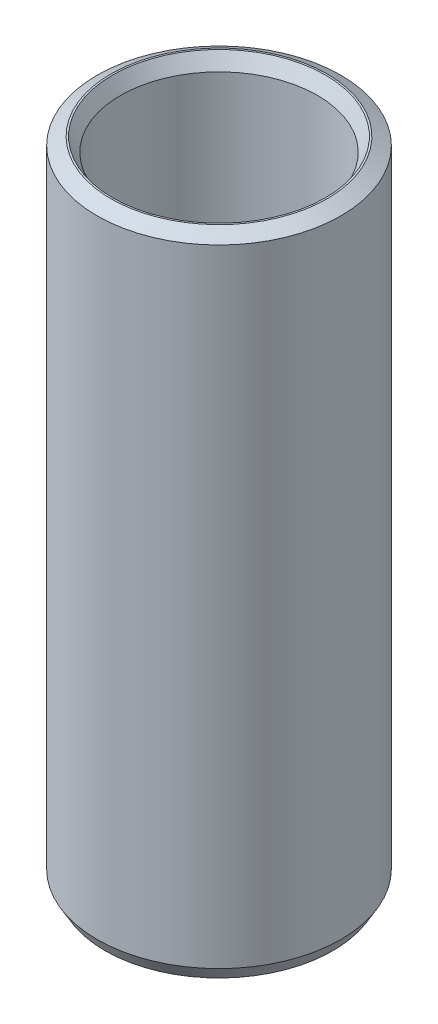
ISO-10303-21;
HEADER;
FILE_DESCRIPTION(('STEP AP214'),'2;1');
FILE_NAME('part.step','',(''),(''),'','','');
FILE_SCHEMA(('AUTOMOTIVE_DESIGN { 1 0 10303 214 1 1 1 1 }'));
ENDSEC;
DATA;
#1=APPLICATION_CONTEXT('core data for automotive mechanical design processes');
#2=APPLICATION_PROTOCOL_DEFINITION('international standard','automotive_design',2000,#1);
#3=PRODUCT_CONTEXT('',#1,'mechanical');
#4=PRODUCT('Part','Part','',(#3));
#5=PRODUCT_RELATED_PRODUCT_CATEGORY('part','',(#4));
#6=PRODUCT_DEFINITION_FORMATION('','',#4);
#7=PRODUCT_DEFINITION_CONTEXT('part definition',#1,'design');
#8=PRODUCT_DEFINITION('design','',#6,#7);
#9=PRODUCT_DEFINITION_SHAPE('','',#8);
#10=(LENGTH_UNIT() NAMED_UNIT(*) SI_UNIT(.MILLI.,.METRE.));
#11=(NAMED_UNIT(*) PLANE_ANGLE_UNIT() SI_UNIT($,.RADIAN.));
#12=(NAMED_UNIT(*) SI_UNIT($,.STERADIAN.) SOLID_ANGLE_UNIT());
#13=UNCERTAINTY_MEASURE_WITH_UNIT(LENGTH_MEASURE(1.E-05),#10,'distance_accuracy_value','');
#14=(GEOMETRIC_REPRESENTATION_CONTEXT(3) GLOBAL_UNCERTAINTY_ASSIGNED_CONTEXT((#13)) GLOBAL_UNIT_ASSIGNED_CONTEXT((#10,
#11,#12)) REPRESENTATION_CONTEXT('',''));
#15=CARTESIAN_POINT('',(0.,0.,0.));
#16=DIRECTION('',(0.,0.,1.));
#17=DIRECTION('',(1.,0.,0.));
#18=AXIS2_PLACEMENT_3D('',#15,#16,#17);
#19=CARTESIAN_POINT('',(0.,199.474999870807,0.));
#20=DIRECTION('',(0.,-1.,0.));
#21=DIRECTION('',(0.,0.,-1.));
#22=AXIS2_PLACEMENT_3D('',#19,#20,#21);
#23=CYLINDRICAL_SURFACE('',#22,37.5);
#24=CARTESIAN_POINT('',(0.,4.22840645598882,0.));
#25=DIRECTION('',(0.,1.,0.));
#26=DIRECTION('',(0.,0.,1.));
#27=AXIS2_PLACEMENT_3D('',#24,#25,#26);
#28=CIRCLE('',#27,37.5);
#29=CARTESIAN_POINT('',(0.,4.22840645598882,37.5));
#30=VERTEX_POINT('',#29);
#31=EDGE_CURVE('E10',#30,#30,#28,.T.);
#32=ORIENTED_EDGE('',*,*,#31,.T.);
#33=EDGE_LOOP('',(#32));
#34=FACE_BOUND('',#33,.T.);
#35=CARTESIAN_POINT('',(0.,197.033728265198,0.));
#36=DIRECTION('',(0.,1.,0.));
#37=DIRECTION('',(0.,0.,1.));
#38=AXIS2_PLACEMENT_3D('',#35,#36,#37);
#39=CIRCLE('',#38,37.5);
#40=CARTESIAN_POINT('',(0.,197.033728265198,-37.5));
#41=VERTEX_POINT('',#40);
#42=EDGE_CURVE('E50',#41,#41,#39,.F.);
#43=ORIENTED_EDGE('',*,*,#42,.T.);
#44=EDGE_LOOP('',(#43));
#45=FACE_BOUND('',#44,.T.);
#46=ADVANCED_FACE('F39',(#34,#45),#23,.T.);
#47=CARTESIAN_POINT('',(0.,199.474999870807,0.));
#48=DIRECTION('',(0.,1.,0.));
#49=DIRECTION('',(0.,0.,1.));
#50=AXIS2_PLACEMENT_3D('',#47,#48,#49);
#51=PLANE('',#50);
#52=CARTESIAN_POINT('',(0.,199.474999870807,0.));
#53=DIRECTION('',(0.,1.,0.));
#54=DIRECTION('',(0.,0.,1.));
#55=AXIS2_PLACEMENT_3D('',#52,#53,#54);
#56=CIRCLE('',#55,32.7359379986227);
#57=CARTESIAN_POINT('',(0.,199.474999870807,32.7359379986227));
#58=VERTEX_POINT('',#57);
#59=EDGE_CURVE('E58',#58,#58,#56,.F.);
#60=ORIENTED_EDGE('',*,*,#59,.T.);
#61=EDGE_LOOP('',(#60));
#62=FACE_BOUND('',#61,.T.);
#63=CARTESIAN_POINT('',(0.,199.474999870807,0.));
#64=DIRECTION('',(0.,1.,0.));
#65=DIRECTION('',(0.,0.,1.));
#66=AXIS2_PLACEMENT_3D('',#63,#64,#65);
#67=CIRCLE('',#66,33.2715935440113);
#68=CARTESIAN_POINT('',(0.,199.474999870807,-33.2715935440113));
#69=VERTEX_POINT('',#68);
#70=EDGE_CURVE('E61',#69,#69,#67,.T.);
#71=ORIENTED_EDGE('',*,*,#70,.T.);
#72=EDGE_LOOP('',(#71));
#73=FACE_BOUND('',#72,.T.);
#74=ADVANCED_FACE('F88',(#62,#73),#51,.T.);
#75=CARTESIAN_POINT('',(0.,0.,0.));
#76=DIRECTION('',(0.,1.,0.));
#77=DIRECTION('',(0.,0.,1.));
#78=AXIS2_PLACEMENT_3D('',#75,#76,#77);
#79=PLANE('',#78);
#80=CARTESIAN_POINT('',(0.,0.,0.));
#81=DIRECTION('',(0.,1.,0.));
#82=DIRECTION('',(0.,0.,1.));
#83=AXIS2_PLACEMENT_3D('',#80,#81,#82);
#84=CIRCLE('',#83,34.5230728490032);
#85=CARTESIAN_POINT('',(0.,0.,-34.5230728490032));
#86=VERTEX_POINT('',#85);
#87=EDGE_CURVE('E51',#86,#86,#84,.T.);
#88=ORIENTED_EDGE('',*,*,#87,.T.);
#89=EDGE_LOOP('',(#88));
#90=FACE_BOUND('',#89,.T.);
#91=CARTESIAN_POINT('',(0.,0.,0.));
#92=DIRECTION('',(0.,1.,0.));
#93=DIRECTION('',(0.,0.,1.));
#94=AXIS2_PLACEMENT_3D('',#91,#92,#93);
#95=CIRCLE('',#94,35.0587283943917);
#96=CARTESIAN_POINT('',(0.,0.,35.0587283943917));
#97=VERTEX_POINT('',#96);
#98=EDGE_CURVE('E54',#97,#97,#95,.F.);
#99=ORIENTED_EDGE('',*,*,#98,.T.);
#100=EDGE_LOOP('',(#99));
#101=FACE_BOUND('',#100,.T.);
#102=ADVANCED_FACE('F83',(#90,#101),#79,.F.);
#103=CARTESIAN_POINT('',(0.,199.474999870807,0.));
#104=DIRECTION('',(0.,-1.,0.));
#105=DIRECTION('',(0.,0.,-1.));
#106=AXIS2_PLACEMENT_3D('',#103,#104,#105);
#107=CYLINDRICAL_SURFACE('',#106,30.2946663930145);
#108=CARTESIAN_POINT('',(0.,195.246593414818,0.));
#109=DIRECTION('',(0.,1.,0.));
#110=DIRECTION('',(0.,0.,1.));
#111=AXIS2_PLACEMENT_3D('',#108,#109,#110);
#112=CIRCLE('',#111,30.2946663930145);
#113=CARTESIAN_POINT('',(0.,195.246593414818,30.2946663930145));
#114=VERTEX_POINT('',#113);
#115=EDGE_CURVE('E67',#114,#114,#112,.T.);
#116=ORIENTED_EDGE('',*,*,#115,.T.);
#117=EDGE_LOOP('',(#116));
#118=FACE_BOUND('',#117,.T.);
#119=CARTESIAN_POINT('',(0.,2.44127160560825,0.));
#120=DIRECTION('',(0.,1.,0.));
#121=DIRECTION('',(0.,0.,1.));
#122=AXIS2_PLACEMENT_3D('',#119,#120,#121);
#123=CIRCLE('',#122,30.2946663930145);
#124=CARTESIAN_POINT('',(0.,2.44127160560825,-30.2946663930145));
#125=VERTEX_POINT('',#124);
#126=EDGE_CURVE('E69',#125,#125,#123,.F.);
#127=ORIENTED_EDGE('',*,*,#126,.T.);
#128=EDGE_LOOP('',(#127));
#129=FACE_BOUND('',#128,.T.);
#130=ADVANCED_FACE('F71',(#118,#129),#107,.F.);
#131=CARTESIAN_POINT('',(0.,195.246593414818,0.));
#132=DIRECTION('',(0.,1.,0.));
#133=DIRECTION('',(0.,0.,1.));
#134=AXIS2_PLACEMENT_3D('',#131,#132,#133);
#135=CONICAL_SURFACE('',#134,30.2946663930145,0.523598775598295);
#136=ORIENTED_EDGE('',*,*,#59,.F.);
#137=EDGE_LOOP('',(#136));
#138=FACE_BOUND('',#137,.T.);
#139=ORIENTED_EDGE('',*,*,#115,.F.);
#140=EDGE_LOOP('',(#139));
#141=FACE_BOUND('',#140,.T.);
#142=ADVANCED_FACE('F77',(#138,#141),#135,.F.);
#143=CARTESIAN_POINT('',(0.,0.,0.));
#144=DIRECTION('',(0.,-1.,0.));
#145=DIRECTION('',(0.,0.,-1.));
#146=AXIS2_PLACEMENT_3D('',#143,#144,#145);
#147=CONICAL_SURFACE('',#146,34.5230728490032,1.0471975511966);
#148=CARTESIAN_POINT('',(0.,2.44127160560825,-30.2946663930145));
#149=CARTESIAN_POINT('',(0.,2.41584169304983,-30.3387122935977));
#150=CARTESIAN_POINT('',(0.,2.39041178049141,-30.3827581941809));
#151=CARTESIAN_POINT('',(0.,2.33955195537458,-30.4708499953474));
#152=CARTESIAN_POINT('',(0.,2.31412204281616,-30.5148958959306));
#153=CARTESIAN_POINT('',(0.,2.26326221769932,-30.602987697097));
#154=CARTESIAN_POINT('',(0.,2.2378323051409,-30.6470335976802));
#155=CARTESIAN_POINT('',(0.,2.18697248002406,-30.7351253988466));
#156=CARTESIAN_POINT('',(0.,2.16154256746564,-30.7791712994299));
#157=CARTESIAN_POINT('',(0.,2.1106827423488,-30.8672631005963));
#158=CARTESIAN_POINT('',(0.,2.08525282979038,-30.9113090011795));
#159=CARTESIAN_POINT('',(0.,2.03439300467354,-30.9994008023459));
#160=CARTESIAN_POINT('',(0.,2.00896309211512,-31.0434467029292));
#161=CARTESIAN_POINT('',(0.,1.95810326699829,-31.1315385040956));
#162=CARTESIAN_POINT('',(0.,1.93267335443987,-31.1755844046788));
#163=CARTESIAN_POINT('',(0.,1.88181352932303,-31.2636762058452));
#164=CARTESIAN_POINT('',(0.,1.85638361676461,-31.3077221064285));
#165=CARTESIAN_POINT('',(0.,1.80552379164777,-31.3958139075949));
#166=CARTESIAN_POINT('',(0.,1.78009387908935,-31.4398598081781));
#167=CARTESIAN_POINT('',(0.,1.72923405397251,-31.5279516093445));
#168=CARTESIAN_POINT('',(0.,1.70380414141409,-31.5719975099278));
#169=CARTESIAN_POINT('',(0.,1.65294431629725,-31.6600893110942));
#170=CARTESIAN_POINT('',(0.,1.62751440373883,-31.7041352116774));
#171=CARTESIAN_POINT('',(0.,1.576654578622,-31.7922270128438));
#172=CARTESIAN_POINT('',(0.,1.55122466606358,-31.836272913427));
#173=CARTESIAN_POINT('',(0.,1.50036484094674,-31.9243647145935));
#174=CARTESIAN_POINT('',(0.,1.47493492838832,-31.9684106151767));
#175=CARTESIAN_POINT('',(0.,1.42407510327148,-32.0565024163431));
#176=CARTESIAN_POINT('',(0.,1.39864519071306,-32.1005483169263));
#177=CARTESIAN_POINT('',(0.,1.34778536559622,-32.1886401180928));
#178=CARTESIAN_POINT('',(0.,1.3223554530378,-32.232686018676));
#179=CARTESIAN_POINT('',(0.,1.27149562792097,-32.3207778198424));
#180=CARTESIAN_POINT('',(0.,1.24606571536255,-32.3648237204256));
#181=CARTESIAN_POINT('',(0.,1.19520589024571,-32.4529155215921));
#182=CARTESIAN_POINT('',(0.,1.16977597768729,-32.4969614221753));
#183=CARTESIAN_POINT('',(0.,1.11891615257045,-32.5850532233417));
#184=CARTESIAN_POINT('',(0.,1.09348624001203,-32.6290991239249));
#185=CARTESIAN_POINT('',(0.,1.04262641489519,-32.7171909250914));
#186=CARTESIAN_POINT('',(0.,1.01719650233677,-32.7612368256746));
#187=CARTESIAN_POINT('',(0.,0.966336677219933,-32.849328626841));
#188=CARTESIAN_POINT('',(0.,0.940906764661514,-32.8933745274242));
#189=CARTESIAN_POINT('',(0.,0.890046939544675,-32.9814663285907));
#190=CARTESIAN_POINT('',(0.,0.864617026986256,-33.0255122291739));
#191=CARTESIAN_POINT('',(0.,0.813757201869418,-33.1136040303403));
#192=CARTESIAN_POINT('',(0.,0.788327289310999,-33.1576499309235));
#193=CARTESIAN_POINT('',(0.,0.73746746419416,-33.24574173209));
#194=CARTESIAN_POINT('',(0.,0.71203755163574,-33.2897876326732));
#195=CARTESIAN_POINT('',(0.,0.661177726518901,-33.3778794338396));
#196=CARTESIAN_POINT('',(0.,0.635747813960482,-33.4219253344228));
#197=CARTESIAN_POINT('',(0.,0.584887988843644,-33.5100171355893));
#198=CARTESIAN_POINT('',(0.,0.559458076285225,-33.5540630361725));
#199=CARTESIAN_POINT('',(0.,0.508598251168386,-33.6421548373389));
#200=CARTESIAN_POINT('',(0.,0.483168338609967,-33.6862007379221));
#201=CARTESIAN_POINT('',(0.,0.432308513493128,-33.7742925390885));
#202=CARTESIAN_POINT('',(0.,0.406878600934709,-33.8183384396718));
#203=CARTESIAN_POINT('',(0.,0.35601877581787,-33.9064302408382));
#204=CARTESIAN_POINT('',(0.,0.330588863259451,-33.9504761414214));
#205=CARTESIAN_POINT('',(0.,0.279729038142613,-34.0385679425878));
#206=CARTESIAN_POINT('',(0.,0.254299125584193,-34.0826138431711));
#207=CARTESIAN_POINT('',(0.,0.203439300467354,-34.1707056443375));
#208=CARTESIAN_POINT('',(0.,0.178009387908935,-34.2147515449207));
#209=CARTESIAN_POINT('',(0.,0.127149562792097,-34.3028433460871));
#210=CARTESIAN_POINT('',(0.,0.101719650233677,-34.3468892466704));
#211=CARTESIAN_POINT('',(0.,0.0508598251168385,-34.4349810478368));
#212=CARTESIAN_POINT('',(0.,0.0254299125584192,-34.47902694842));
#213=CARTESIAN_POINT('',(0.,0.,-34.5230728490032));
#214=B_SPLINE_CURVE_WITH_KNOTS('',3,(#148,#149,#150,#151,#152,#153,#154,#155,#156,#157,#158,
#159,#160,#161,#162,#163,#164,#165,#166,#167,#168,#169,#170,#171,#172,#173,#174,#175,#176,#177,
#178,#179,#180,#181,#182,#183,#184,#185,#186,#187,#188,#189,#190,#191,#192,#193,#194,#195,#196,
#197,#198,#199,#200,#201,#202,#203,#204,#205,#206,#207,#208,#209,#210,#211,#212,#213),
.UNSPECIFIED.,.F.,.F.,(4,2,2,2,2,2,2,2,2,2,2,2,2,2,2,2,2,2,2,2,2,2,2,2,2,2,2,2,2,2,2,2,4),(0.,
0.152579475350516,0.30515895070103,0.457738426051546,0.610317901402062,0.762897376752576,
0.915476852103092,1.06805632745361,1.22063580280412,1.37321527815464,1.52579475350515,
1.67837422885567,1.83095370420618,1.9835331795567,2.13611265490722,2.28869213025773,
2.44127160560824,2.59385108095876,2.74643055630928,2.89901003165979,3.05158950701031,
3.20416898236082,3.35674845771134,3.50932793306185,3.66190740841237,3.81448688376288,
3.9670663591134,4.11964583446392,4.27222530981443,4.42480478516494,4.57738426051546,
4.72996373586598,4.88254321121649),.UNSPECIFIED.);
#215=EDGE_CURVE('BSEAM73',#125,#86,#214,.T.);
#216=ORIENTED_EDGE('',*,*,#126,.F.);
#217=ORIENTED_EDGE('',*,*,#87,.F.);
#218=ORIENTED_EDGE('',*,*,#215,.T.);
#219=ORIENTED_EDGE('',*,*,#215,.F.);
#220=EDGE_LOOP('',(#216,#218,#217,#219));
#221=FACE_BOUND('',#220,.T.);
#222=ADVANCED_FACE('F73',(#221),#147,.F.);
#223=CARTESIAN_POINT('',(0.,4.22840645598882,0.));
#224=DIRECTION('',(0.,1.,0.));
#225=DIRECTION('',(0.,0.,1.));
#226=AXIS2_PLACEMENT_3D('',#223,#224,#225);
#227=CONICAL_SURFACE('',#226,37.5,0.523598775598301);
#228=ORIENTED_EDGE('',*,*,#98,.F.);
#229=EDGE_LOOP('',(#228));
#230=FACE_BOUND('',#229,.T.);
#231=ORIENTED_EDGE('',*,*,#31,.F.);
#232=EDGE_LOOP('',(#231));
#233=FACE_BOUND('',#232,.T.);
#234=ADVANCED_FACE('F76',(#230,#233),#227,.T.);
#235=CARTESIAN_POINT('',(0.,199.474999870807,0.));
#236=DIRECTION('',(0.,-1.,0.));
#237=DIRECTION('',(0.,0.,-1.));
#238=AXIS2_PLACEMENT_3D('',#235,#236,#237);
#239=CONICAL_SURFACE('',#238,33.2715935440113,1.04719755119659);
#240=CARTESIAN_POINT('',(0.,197.033728265198,-37.5));
#241=CARTESIAN_POINT('',(0.,197.059158177757,-37.4559540994168));
#242=CARTESIAN_POINT('',(0.,197.084588090315,-37.4119081988336));
#243=CARTESIAN_POINT('',(0.,197.135447915432,-37.3238163976672));
#244=CARTESIAN_POINT('',(0.,197.16087782799,-37.279770497084));
#245=CARTESIAN_POINT('',(0.,197.211737653107,-37.1916786959175));
#246=CARTESIAN_POINT('',(0.,197.237167565666,-37.1476327953343));
#247=CARTESIAN_POINT('',(0.,197.288027390783,-37.0595409941679));
#248=CARTESIAN_POINT('',(0.,197.313457303341,-37.0154950935847));
#249=CARTESIAN_POINT('',(0.,197.364317128458,-36.9274032924182));
#250=CARTESIAN_POINT('',(0.,197.389747041016,-36.883357391835));
#251=CARTESIAN_POINT('',(0.,197.440606866133,-36.7952655906686));
#252=CARTESIAN_POINT('',(0.,197.466036778692,-36.7512196900854));
#253=CARTESIAN_POINT('',(0.,197.516896603808,-36.6631278889189));
#254=CARTESIAN_POINT('',(0.,197.542326516367,-36.6190819883357));
#255=CARTESIAN_POINT('',(0.,197.593186341484,-36.5309901871693));
#256=CARTESIAN_POINT('',(0.,197.618616254042,-36.4869442865861));
#257=CARTESIAN_POINT('',(0.,197.669476079159,-36.3988524854196));
#258=CARTESIAN_POINT('',(0.,197.694905991717,-36.3548065848364));
#259=CARTESIAN_POINT('',(0.,197.745765816834,-36.26671478367));
#260=CARTESIAN_POINT('',(0.,197.771195729393,-36.2226688830868));
#261=CARTESIAN_POINT('',(0.,197.822055554509,-36.1345770819203));
#262=CARTESIAN_POINT('',(0.,197.847485467068,-36.0905311813371));
#263=CARTESIAN_POINT('',(0.,197.898345292185,-36.0024393801707));
#264=CARTESIAN_POINT('',(0.,197.923775204743,-35.9583934795875));
#265=CARTESIAN_POINT('',(0.,197.97463502986,-35.8703016784211));
#266=CARTESIAN_POINT('',(0.,198.000064942418,-35.8262557778378));
#267=CARTESIAN_POINT('',(0.,198.050924767535,-35.7381639766714));
#268=CARTESIAN_POINT('',(0.,198.076354680094,-35.6941180760882));
#269=CARTESIAN_POINT('',(0.,198.12721450521,-35.6060262749218));
#270=CARTESIAN_POINT('',(0.,198.152644417769,-35.5619803743385));
#271=CARTESIAN_POINT('',(0.,198.203504242886,-35.4738885731721));
#272=CARTESIAN_POINT('',(0.,198.228934155444,-35.4298426725889));
#273=CARTESIAN_POINT('',(0.,198.279793980561,-35.3417508714225));
#274=CARTESIAN_POINT('',(0.,198.305223893119,-35.2977049708392));
#275=CARTESIAN_POINT('',(0.,198.356083718236,-35.2096131696728));
#276=CARTESIAN_POINT('',(0.,198.381513630795,-35.1655672690896));
#277=CARTESIAN_POINT('',(0.,198.432373455911,-35.0774754679232));
#278=CARTESIAN_POINT('',(0.,198.45780336847,-35.03342956734));
#279=CARTESIAN_POINT('',(0.,198.508663193587,-34.9453377661735));
#280=CARTESIAN_POINT('',(0.,198.534093106145,-34.9012918655903));
#281=CARTESIAN_POINT('',(0.,198.584952931262,-34.8132000644239));
#282=CARTESIAN_POINT('',(0.,198.61038284382,-34.7691541638407));
#283=CARTESIAN_POINT('',(0.,198.661242668937,-34.6810623626742));
#284=CARTESIAN_POINT('',(0.,198.686672581496,-34.637016462091));
#285=CARTESIAN_POINT('',(0.,198.737532406612,-34.5489246609246));
#286=CARTESIAN_POINT('',(0.,198.762962319171,-34.5048787603414));
#287=CARTESIAN_POINT('',(0.,198.813822144288,-34.4167869591749));
#288=CARTESIAN_POINT('',(0.,198.839252056846,-34.3727410585917));
#289=CARTESIAN_POINT('',(0.,198.890111881963,-34.2846492574253));
#290=CARTESIAN_POINT('',(0.,198.915541794521,-34.2406033568421));
#291=CARTESIAN_POINT('',(0.,198.966401619638,-34.1525115556756));
#292=CARTESIAN_POINT('',(0.,198.991831532197,-34.1084656550924));
#293=CARTESIAN_POINT('',(0.,199.042691357313,-34.020373853926));
#294=CARTESIAN_POINT('',(0.,199.068121269872,-33.9763279533428));
#295=CARTESIAN_POINT('',(0.,199.118981094989,-33.8882361521763));
#296=CARTESIAN_POINT('',(0.,199.144411007547,-33.8441902515931));
#297=CARTESIAN_POINT('',(0.,199.195270832664,-33.7560984504267));
#298=CARTESIAN_POINT('',(0.,199.220700745222,-33.7120525498435));
#299=CARTESIAN_POINT('',(0.,199.271560570339,-33.623960748677));
#300=CARTESIAN_POINT('',(0.,199.296990482898,-33.5799148480938));
#301=CARTESIAN_POINT('',(0.,199.347850308015,-33.4918230469274));
#302=CARTESIAN_POINT('',(0.,199.373280220573,-33.4477771463442));
#303=CARTESIAN_POINT('',(0.,199.42414004569,-33.3596853451777));
#304=CARTESIAN_POINT('',(0.,199.449569958248,-33.3156394445945));
#305=CARTESIAN_POINT('',(0.,199.474999870807,-33.2715935440113));
#306=B_SPLINE_CURVE_WITH_KNOTS('',3,(#240,#241,#242,#243,#244,#245,#246,#247,#248,#249,#250,
#251,#252,#253,#254,#255,#256,#257,#258,#259,#260,#261,#262,#263,#264,#265,#266,#267,#268,#269,
#270,#271,#272,#273,#274,#275,#276,#277,#278,#279,#280,#281,#282,#283,#284,#285,#286,#287,#288,
#289,#290,#291,#292,#293,#294,#295,#296,#297,#298,#299,#300,#301,#302,#303,#304,#305),
.UNSPECIFIED.,.F.,.F.,(4,2,2,2,2,2,2,2,2,2,2,2,2,2,2,2,2,2,2,2,2,2,2,2,2,2,2,2,2,2,2,2,4),(0.,
0.152579475350518,0.305158950701036,0.457738426051554,0.610317901402066,0.762897376752585,
0.915476852103103,1.06805632745362,1.22063580280412,1.37321527815464,1.52579475350516,
1.67837422885567,1.83095370420619,1.9835331795567,2.13611265490722,2.28869213025774,
2.44127160560824,2.59385108095876,2.74643055630927,2.89901003165979,3.0515895070103,
3.20416898236082,3.35674845771134,3.50932793306186,3.66190740841236,3.81448688376287,
3.96706635911339,4.11964583446391,4.27222530981443,4.42480478516494,4.57738426051546,
4.72996373586598,4.8825432112165),.UNSPECIFIED.);
#307=EDGE_CURVE('BSEAM45',#41,#69,#306,.T.);
#308=ORIENTED_EDGE('',*,*,#42,.F.);
#309=ORIENTED_EDGE('',*,*,#70,.F.);
#310=ORIENTED_EDGE('',*,*,#307,.T.);
#311=ORIENTED_EDGE('',*,*,#307,.F.);
#312=EDGE_LOOP('',(#308,#310,#309,#311));
#313=FACE_BOUND('',#312,.T.);
#314=ADVANCED_FACE('F45',(#313),#239,.T.);
#315=CLOSED_SHELL('',(#46,#74,#102,#130,#142,#222,#234,#314));
#316=MANIFOLD_SOLID_BREP('B2',#315);
#317=ADVANCED_BREP_SHAPE_REPRESENTATION('',(#18,#316),#14);
#318=SHAPE_DEFINITION_REPRESENTATION(#9,#317);
ENDSEC;
END-ISO-10303-21;
